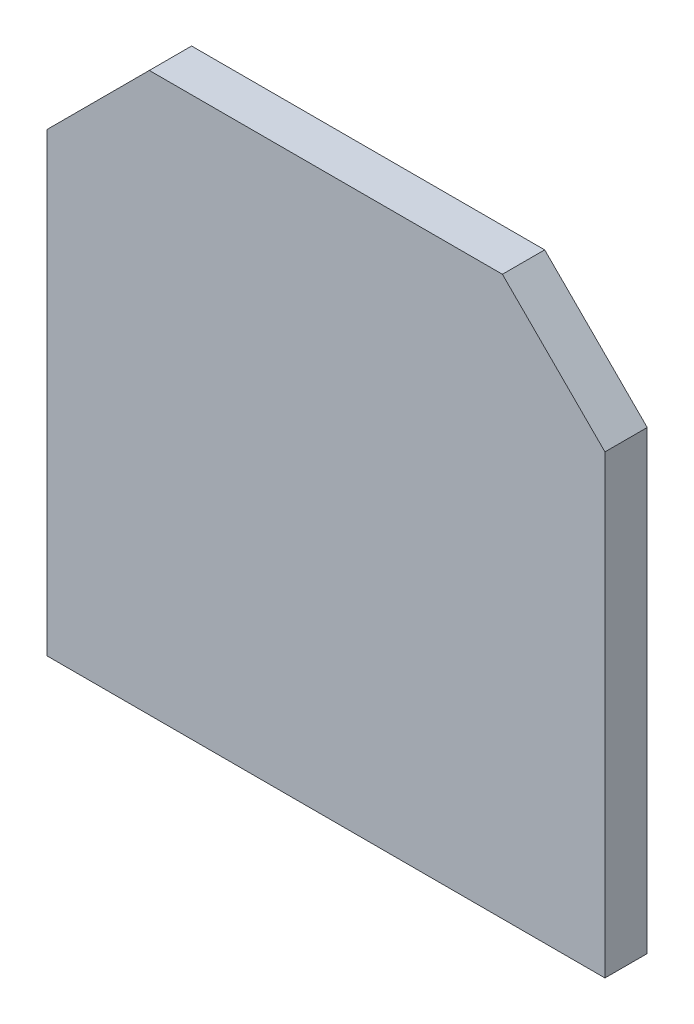
ISO-10303-21;
HEADER;
FILE_DESCRIPTION(('STEP AP214'),'2;1');
FILE_NAME('part.step','',(''),(''),'','','');
FILE_SCHEMA(('AUTOMOTIVE_DESIGN { 1 0 10303 214 1 1 1 1 }'));
ENDSEC;
DATA;
#1=APPLICATION_CONTEXT('core data for automotive mechanical design processes');
#2=APPLICATION_PROTOCOL_DEFINITION('international standard','automotive_design',2000,#1);
#3=PRODUCT_CONTEXT('',#1,'mechanical');
#4=PRODUCT('Part','Part','',(#3));
#5=PRODUCT_RELATED_PRODUCT_CATEGORY('part','',(#4));
#6=PRODUCT_DEFINITION_FORMATION('','',#4);
#7=PRODUCT_DEFINITION_CONTEXT('part definition',#1,'design');
#8=PRODUCT_DEFINITION('design','',#6,#7);
#9=PRODUCT_DEFINITION_SHAPE('','',#8);
#10=(LENGTH_UNIT() NAMED_UNIT(*) SI_UNIT(.MILLI.,.METRE.));
#11=(NAMED_UNIT(*) PLANE_ANGLE_UNIT() SI_UNIT($,.RADIAN.));
#12=(NAMED_UNIT(*) SI_UNIT($,.STERADIAN.) SOLID_ANGLE_UNIT());
#13=UNCERTAINTY_MEASURE_WITH_UNIT(LENGTH_MEASURE(1.E-05),#10,'distance_accuracy_value','');
#14=(GEOMETRIC_REPRESENTATION_CONTEXT(3) GLOBAL_UNCERTAINTY_ASSIGNED_CONTEXT((#13)) GLOBAL_UNIT_ASSIGNED_CONTEXT((#10,
#11,#12)) REPRESENTATION_CONTEXT('',''));
#15=CARTESIAN_POINT('',(0.,0.,0.));
#16=DIRECTION('',(0.,0.,1.));
#17=DIRECTION('',(1.,0.,0.));
#18=AXIS2_PLACEMENT_3D('',#15,#16,#17);
#19=CARTESIAN_POINT('',(2.561330051462E-06,-0.424143433852,1.00000054));
#20=DIRECTION('',(0.,0.,-1.));
#21=DIRECTION('',(-1.,0.,0.));
#22=AXIS2_PLACEMENT_3D('',#19,#20,#21);
#23=PLANE('',#22);
#24=DIRECTION('',(1.,0.,0.));
#25=VECTOR('',#24,1.);
#26=CARTESIAN_POINT('',(6.6005075,-6.60051004,1.00000054));
#27=LINE('',#26,#25);
#28=CARTESIAN_POINT('',(6.6005075,-6.60051004,1.00000054));
#29=VERTEX_POINT('',#28);
#30=CARTESIAN_POINT('',(-6.6005075,-6.60051004,1.00000054));
#31=VERTEX_POINT('',#30);
#32=EDGE_CURVE('E105',#29,#31,#27,.F.);
#33=ORIENTED_EDGE('',*,*,#32,.F.);
#34=DIRECTION('',(0.,1.,0.));
#35=VECTOR('',#34,1.);
#36=CARTESIAN_POINT('',(6.6005075,4.17520882,1.00000054));
#37=LINE('',#36,#35);
#38=CARTESIAN_POINT('',(6.6005075,4.17520882,1.00000054));
#39=VERTEX_POINT('',#38);
#40=EDGE_CURVE('E110',#39,#29,#37,.F.);
#41=ORIENTED_EDGE('',*,*,#40,.F.);
#42=DIRECTION('',(-0.707106781186548,0.707106781186548,0.));
#43=VECTOR('',#42,1.);
#44=CARTESIAN_POINT('',(4.17520628,6.60051004,1.00000054));
#45=LINE('',#44,#43);
#46=CARTESIAN_POINT('',(4.17520628,6.60051004,1.00000054));
#47=VERTEX_POINT('',#46);
#48=EDGE_CURVE('E83',#47,#39,#45,.F.);
#49=ORIENTED_EDGE('',*,*,#48,.F.);
#50=DIRECTION('',(1.,0.,0.));
#51=VECTOR('',#50,1.);
#52=CARTESIAN_POINT('',(-4.17520628,6.60051004,1.00000054));
#53=LINE('',#52,#51);
#54=CARTESIAN_POINT('',(-4.17520628,6.60051004,1.00000054));
#55=VERTEX_POINT('',#54);
#56=EDGE_CURVE('E80',#55,#47,#53,.T.);
#57=ORIENTED_EDGE('',*,*,#56,.F.);
#58=DIRECTION('',(-0.707106781186548,-0.707106781186548,0.));
#59=VECTOR('',#58,1.);
#60=CARTESIAN_POINT('',(-6.6003297,4.17538662,1.00000054));
#61=LINE('',#60,#59);
#62=CARTESIAN_POINT('',(-6.6004186,4.17519358,1.00000054));
#63=VERTEX_POINT('',#62);
#64=EDGE_CURVE('E66',#63,#55,#61,.F.);
#65=ORIENTED_EDGE('',*,*,#64,.F.);
#66=DIRECTION('',(0.,1.,0.));
#67=VECTOR('',#66,1.);
#68=CARTESIAN_POINT('',(-6.6005075,-6.60051004,1.00000054));
#69=LINE('',#68,#67);
#70=EDGE_CURVE('E99',#31,#63,#69,.T.);
#71=ORIENTED_EDGE('',*,*,#70,.F.);
#72=EDGE_LOOP('',(#33,#41,#49,#57,#65,#71));
#73=FACE_BOUND('',#72,.T.);
#74=ADVANCED_FACE('F17',(#73),#23,.F.);
#75=CARTESIAN_POINT('',(-6.6003297,4.17538662,0.));
#76=DIRECTION('',(-0.707106781186548,0.707106781186548,0.));
#77=DIRECTION('',(-0.707106781186548,-0.707106781186548,0.));
#78=AXIS2_PLACEMENT_3D('',#75,#76,#77);
#79=PLANE('',#78);
#80=DIRECTION('',(0.,0.,1.));
#81=VECTOR('',#80,1.);
#82=CARTESIAN_POINT('',(-4.17520628,6.60051004,0.));
#83=LINE('',#82,#81);
#84=CARTESIAN_POINT('',(-4.17520628,6.60051004,0.));
#85=VERTEX_POINT('',#84);
#86=EDGE_CURVE('E71',#85,#55,#83,.T.);
#87=ORIENTED_EDGE('',*,*,#86,.F.);
#88=DIRECTION('',(0.707106781186548,0.707106781186548,0.));
#89=VECTOR('',#88,1.);
#90=CARTESIAN_POINT('',(-6.6003297,4.17538662,0.));
#91=LINE('',#90,#89);
#92=CARTESIAN_POINT('',(-6.6004186,4.17519358,0.));
#93=VERTEX_POINT('',#92);
#94=EDGE_CURVE('E119',#93,#85,#91,.T.);
#95=ORIENTED_EDGE('',*,*,#94,.F.);
#96=DIRECTION('',(0.,0.,-1.));
#97=VECTOR('',#96,1.);
#98=CARTESIAN_POINT('',(-6.6005075,4.17520882,0.));
#99=LINE('',#98,#97);
#100=EDGE_CURVE('E74',#63,#93,#99,.T.);
#101=ORIENTED_EDGE('',*,*,#100,.F.);
#102=ORIENTED_EDGE('',*,*,#64,.T.);
#103=EDGE_LOOP('',(#87,#95,#101,#102));
#104=FACE_BOUND('',#103,.T.);
#105=ADVANCED_FACE('F68',(#104),#79,.T.);
#106=CARTESIAN_POINT('',(-4.17520628,6.60051004,0.));
#107=DIRECTION('',(0.,1.,0.));
#108=DIRECTION('',(0.,0.,1.));
#109=AXIS2_PLACEMENT_3D('',#106,#107,#108);
#110=PLANE('',#109);
#111=DIRECTION('',(0.,0.,1.));
#112=VECTOR('',#111,1.);
#113=CARTESIAN_POINT('',(4.17520628,6.60051004,0.));
#114=LINE('',#113,#112);
#115=CARTESIAN_POINT('',(4.17520628,6.60051004,0.));
#116=VERTEX_POINT('',#115);
#117=EDGE_CURVE('E86',#116,#47,#114,.T.);
#118=ORIENTED_EDGE('',*,*,#117,.F.);
#119=DIRECTION('',(-1.,0.,0.));
#120=VECTOR('',#119,1.);
#121=CARTESIAN_POINT('',(2.561330051462E-06,6.60051004,0.));
#122=LINE('',#121,#120);
#123=EDGE_CURVE('E90',#85,#116,#122,.F.);
#124=ORIENTED_EDGE('',*,*,#123,.F.);
#125=ORIENTED_EDGE('',*,*,#86,.T.);
#126=ORIENTED_EDGE('',*,*,#56,.T.);
#127=EDGE_LOOP('',(#118,#124,#125,#126));
#128=FACE_BOUND('',#127,.T.);
#129=ADVANCED_FACE('F88',(#128),#110,.T.);
#130=CARTESIAN_POINT('',(4.17520628,6.60051004,0.));
#131=DIRECTION('',(0.707106781186548,0.707106781186548,0.));
#132=DIRECTION('',(-0.707106781186548,0.707106781186548,0.));
#133=AXIS2_PLACEMENT_3D('',#130,#131,#132);
#134=PLANE('',#133);
#135=DIRECTION('',(0.,0.,-1.));
#136=VECTOR('',#135,1.);
#137=CARTESIAN_POINT('',(6.6005075,4.17520882,0.));
#138=LINE('',#137,#136);
#139=CARTESIAN_POINT('',(6.6005075,4.17520882,0.));
#140=VERTEX_POINT('',#139);
#141=EDGE_CURVE('E112',#140,#39,#138,.F.);
#142=ORIENTED_EDGE('',*,*,#141,.F.);
#143=DIRECTION('',(0.707106781186547,-0.707106781186548,0.));
#144=VECTOR('',#143,1.);
#145=CARTESIAN_POINT('',(4.17520628,6.60051004,0.));
#146=LINE('',#145,#144);
#147=EDGE_CURVE('E123',#116,#140,#146,.T.);
#148=ORIENTED_EDGE('',*,*,#147,.F.);
#149=ORIENTED_EDGE('',*,*,#117,.T.);
#150=ORIENTED_EDGE('',*,*,#48,.T.);
#151=EDGE_LOOP('',(#142,#148,#149,#150));
#152=FACE_BOUND('',#151,.T.);
#153=ADVANCED_FACE('F157',(#152),#134,.T.);
#154=CARTESIAN_POINT('',(6.6005075,4.17520882,0.));
#155=DIRECTION('',(1.,0.,0.));
#156=DIRECTION('',(0.,0.,-1.));
#157=AXIS2_PLACEMENT_3D('',#154,#155,#156);
#158=PLANE('',#157);
#159=DIRECTION('',(0.,0.,-1.));
#160=VECTOR('',#159,1.);
#161=CARTESIAN_POINT('',(6.6005075,-6.60051004,0.));
#162=LINE('',#161,#160);
#163=CARTESIAN_POINT('',(6.6005075,-6.60051004,0.));
#164=VERTEX_POINT('',#163);
#165=EDGE_CURVE('E107',#164,#29,#162,.F.);
#166=ORIENTED_EDGE('',*,*,#165,.F.);
#167=DIRECTION('',(0.,1.,0.));
#168=VECTOR('',#167,1.);
#169=CARTESIAN_POINT('',(6.6005075,-0.424143433852,0.));
#170=LINE('',#169,#168);
#171=EDGE_CURVE('E134',#140,#164,#170,.F.);
#172=ORIENTED_EDGE('',*,*,#171,.F.);
#173=ORIENTED_EDGE('',*,*,#141,.T.);
#174=ORIENTED_EDGE('',*,*,#40,.T.);
#175=EDGE_LOOP('',(#166,#172,#173,#174));
#176=FACE_BOUND('',#175,.T.);
#177=ADVANCED_FACE('F172',(#176),#158,.T.);
#178=CARTESIAN_POINT('',(6.6005075,-6.60051004,0.));
#179=DIRECTION('',(0.,-1.,0.));
#180=DIRECTION('',(0.,0.,-1.));
#181=AXIS2_PLACEMENT_3D('',#178,#179,#180);
#182=PLANE('',#181);
#183=DIRECTION('',(0.,0.,1.));
#184=VECTOR('',#183,1.);
#185=CARTESIAN_POINT('',(-6.6005075,-6.60051004,0.));
#186=LINE('',#185,#184);
#187=CARTESIAN_POINT('',(-6.6005075,-6.60051004,0.));
#188=VERTEX_POINT('',#187);
#189=EDGE_CURVE('E35',#188,#31,#186,.T.);
#190=ORIENTED_EDGE('',*,*,#189,.F.);
#191=DIRECTION('',(-1.,0.,0.));
#192=VECTOR('',#191,1.);
#193=CARTESIAN_POINT('',(2.561330051462E-06,-6.60051004,0.));
#194=LINE('',#193,#192);
#195=EDGE_CURVE('E26',#164,#188,#194,.T.);
#196=ORIENTED_EDGE('',*,*,#195,.F.);
#197=ORIENTED_EDGE('',*,*,#165,.T.);
#198=ORIENTED_EDGE('',*,*,#32,.T.);
#199=EDGE_LOOP('',(#190,#196,#197,#198));
#200=FACE_BOUND('',#199,.T.);
#201=ADVANCED_FACE('F167',(#200),#182,.T.);
#202=CARTESIAN_POINT('',(-6.6005075,-6.60051004,0.));
#203=DIRECTION('',(-1.,0.,0.));
#204=DIRECTION('',(0.,0.,1.));
#205=AXIS2_PLACEMENT_3D('',#202,#203,#204);
#206=PLANE('',#205);
#207=ORIENTED_EDGE('',*,*,#100,.T.);
#208=DIRECTION('',(0.,1.,0.));
#209=VECTOR('',#208,1.);
#210=CARTESIAN_POINT('',(-6.6005075,-0.424143433852,0.));
#211=LINE('',#210,#209);
#212=EDGE_CURVE('E11',#188,#93,#211,.T.);
#213=ORIENTED_EDGE('',*,*,#212,.F.);
#214=ORIENTED_EDGE('',*,*,#189,.T.);
#215=ORIENTED_EDGE('',*,*,#70,.T.);
#216=EDGE_LOOP('',(#207,#213,#214,#215));
#217=FACE_BOUND('',#216,.T.);
#218=ADVANCED_FACE('F161',(#217),#206,.T.);
#219=CARTESIAN_POINT('',(2.561330051462E-06,-0.424143433852,0.));
#220=DIRECTION('',(0.,0.,-1.));
#221=DIRECTION('',(-1.,0.,0.));
#222=AXIS2_PLACEMENT_3D('',#219,#220,#221);
#223=PLANE('',#222);
#224=ORIENTED_EDGE('',*,*,#195,.T.);
#225=ORIENTED_EDGE('',*,*,#212,.T.);
#226=ORIENTED_EDGE('',*,*,#94,.T.);
#227=ORIENTED_EDGE('',*,*,#123,.T.);
#228=ORIENTED_EDGE('',*,*,#147,.T.);
#229=ORIENTED_EDGE('',*,*,#171,.T.);
#230=EDGE_LOOP('',(#224,#225,#226,#227,#228,#229));
#231=FACE_BOUND('',#230,.T.);
#232=ADVANCED_FACE('F159',(#231),#223,.T.);
#233=CLOSED_SHELL('',(#74,#105,#129,#153,#177,#201,#218,#232));
#234=MANIFOLD_SOLID_BREP('B1',#233);
#235=ADVANCED_BREP_SHAPE_REPRESENTATION('',(#18,#234),#14);
#236=SHAPE_DEFINITION_REPRESENTATION(#9,#235);
ENDSEC;
END-ISO-10303-21;
